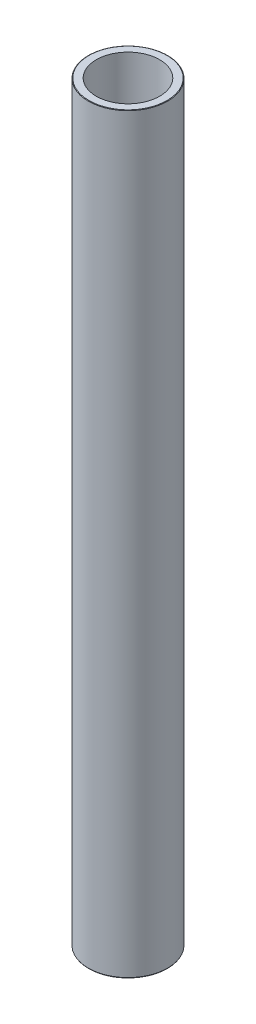
ISO-10303-21;
HEADER;
FILE_DESCRIPTION(('STEP AP214'),'2;1');
FILE_NAME('part.step','',(''),(''),'','','');
FILE_SCHEMA(('AUTOMOTIVE_DESIGN { 1 0 10303 214 1 1 1 1 }'));
ENDSEC;
DATA;
#1=APPLICATION_CONTEXT('core data for automotive mechanical design processes');
#2=APPLICATION_PROTOCOL_DEFINITION('international standard','automotive_design',2000,#1);
#3=PRODUCT_CONTEXT('',#1,'mechanical');
#4=PRODUCT('Part','Part','',(#3));
#5=PRODUCT_RELATED_PRODUCT_CATEGORY('part','',(#4));
#6=PRODUCT_DEFINITION_FORMATION('','',#4);
#7=PRODUCT_DEFINITION_CONTEXT('part definition',#1,'design');
#8=PRODUCT_DEFINITION('design','',#6,#7);
#9=PRODUCT_DEFINITION_SHAPE('','',#8);
#10=(LENGTH_UNIT() NAMED_UNIT(*) SI_UNIT(.MILLI.,.METRE.));
#11=(NAMED_UNIT(*) PLANE_ANGLE_UNIT() SI_UNIT($,.RADIAN.));
#12=(NAMED_UNIT(*) SI_UNIT($,.STERADIAN.) SOLID_ANGLE_UNIT());
#13=UNCERTAINTY_MEASURE_WITH_UNIT(LENGTH_MEASURE(1.E-05),#10,'distance_accuracy_value','');
#14=(GEOMETRIC_REPRESENTATION_CONTEXT(3) GLOBAL_UNCERTAINTY_ASSIGNED_CONTEXT((#13)) GLOBAL_UNIT_ASSIGNED_CONTEXT((#10,
#11,#12)) REPRESENTATION_CONTEXT('',''));
#15=CARTESIAN_POINT('',(0.,0.,0.));
#16=DIRECTION('',(0.,0.,1.));
#17=DIRECTION('',(1.,0.,0.));
#18=AXIS2_PLACEMENT_3D('',#15,#16,#17);
#19=CARTESIAN_POINT('',(0.,569.152457973515,0.));
#20=DIRECTION('',(0.,-1.,0.));
#21=DIRECTION('',(0.,0.,-1.));
#22=AXIS2_PLACEMENT_3D('',#19,#20,#21);
#23=CYLINDRICAL_SURFACE('',#22,30.);
#24=CARTESIAN_POINT('',(0.,568.898428323587,0.));
#25=DIRECTION('',(0.,1.,0.));
#26=DIRECTION('',(0.,0.,1.));
#27=AXIS2_PLACEMENT_3D('',#24,#25,#26);
#28=CIRCLE('',#27,30.);
#29=CARTESIAN_POINT('',(0.,568.898428323587,30.));
#30=VERTEX_POINT('',#29);
#31=EDGE_CURVE('E50',#30,#30,#28,.F.);
#32=ORIENTED_EDGE('',*,*,#31,.T.);
#33=EDGE_LOOP('',(#32));
#34=FACE_BOUND('',#33,.T.);
#35=CARTESIAN_POINT('',(0.,0.439992260305333,0.));
#36=DIRECTION('',(0.,1.,0.));
#37=DIRECTION('',(0.,0.,1.));
#38=AXIS2_PLACEMENT_3D('',#35,#36,#37);
#39=CIRCLE('',#38,30.);
#40=CARTESIAN_POINT('',(0.,0.439992260305333,30.));
#41=VERTEX_POINT('',#40);
#42=EDGE_CURVE('E51',#41,#41,#39,.T.);
#43=ORIENTED_EDGE('',*,*,#42,.T.);
#44=EDGE_LOOP('',(#43));
#45=FACE_BOUND('',#44,.T.);
#46=ADVANCED_FACE('F39',(#34,#45),#23,.T.);
#47=CARTESIAN_POINT('',(0.,569.152457973515,0.));
#48=DIRECTION('',(0.,1.,0.));
#49=DIRECTION('',(0.,0.,1.));
#50=AXIS2_PLACEMENT_3D('',#47,#48,#49);
#51=PLANE('',#50);
#52=CARTESIAN_POINT('',(0.,569.152457973515,0.));
#53=DIRECTION('',(0.,1.,0.));
#54=DIRECTION('',(0.,0.,1.));
#55=AXIS2_PLACEMENT_3D('',#52,#53,#54);
#56=CIRCLE('',#55,29.5600077396948);
#57=CARTESIAN_POINT('',(0.,569.152457973515,29.5600077396948));
#58=VERTEX_POINT('',#57);
#59=EDGE_CURVE('E54',#58,#58,#56,.T.);
#60=ORIENTED_EDGE('',*,*,#59,.T.);
#61=EDGE_LOOP('',(#60));
#62=FACE_BOUND('',#61,.T.);
#63=CARTESIAN_POINT('',(0.,569.152457973515,0.));
#64=DIRECTION('',(0.,1.,0.));
#65=DIRECTION('',(0.,0.,1.));
#66=AXIS2_PLACEMENT_3D('',#63,#64,#65);
#67=CIRCLE('',#66,24.0075079726526);
#68=CARTESIAN_POINT('',(0.,569.152457973515,24.0075079726526));
#69=VERTEX_POINT('',#68);
#70=EDGE_CURVE('E58',#69,#69,#67,.T.);
#71=ORIENTED_EDGE('',*,*,#70,.F.);
#72=EDGE_LOOP('',(#71));
#73=FACE_BOUND('',#72,.T.);
#74=ADVANCED_FACE('F69',(#62,#73),#51,.T.);
#75=CARTESIAN_POINT('',(0.,0.,0.));
#76=DIRECTION('',(0.,1.,0.));
#77=DIRECTION('',(0.,0.,1.));
#78=AXIS2_PLACEMENT_3D('',#75,#76,#77);
#79=PLANE('',#78);
#80=CARTESIAN_POINT('',(0.,0.,0.));
#81=DIRECTION('',(0.,1.,0.));
#82=DIRECTION('',(0.,0.,1.));
#83=AXIS2_PLACEMENT_3D('',#80,#81,#82);
#84=CIRCLE('',#83,29.7459703500713);
#85=CARTESIAN_POINT('',(0.,0.,29.7459703500713));
#86=VERTEX_POINT('',#85);
#87=EDGE_CURVE('E10',#86,#86,#84,.F.);
#88=ORIENTED_EDGE('',*,*,#87,.T.);
#89=EDGE_LOOP('',(#88));
#90=FACE_BOUND('',#89,.T.);
#91=CARTESIAN_POINT('',(0.,0.,0.));
#92=DIRECTION('',(0.,1.,0.));
#93=DIRECTION('',(0.,0.,1.));
#94=AXIS2_PLACEMENT_3D('',#91,#92,#93);
#95=CIRCLE('',#94,24.0075079726526);
#96=CARTESIAN_POINT('',(0.,0.,24.0075079726526));
#97=VERTEX_POINT('',#96);
#98=EDGE_CURVE('E63',#97,#97,#95,.T.);
#99=ORIENTED_EDGE('',*,*,#98,.T.);
#100=EDGE_LOOP('',(#99));
#101=FACE_BOUND('',#100,.T.);
#102=ADVANCED_FACE('F75',(#90,#101),#79,.F.);
#103=CARTESIAN_POINT('',(0.,569.152457973515,0.));
#104=DIRECTION('',(0.,-1.,0.));
#105=DIRECTION('',(0.,0.,-1.));
#106=AXIS2_PLACEMENT_3D('',#103,#104,#105);
#107=CYLINDRICAL_SURFACE('',#106,24.0075079726526);
#108=ORIENTED_EDGE('',*,*,#70,.T.);
#109=EDGE_LOOP('',(#108));
#110=FACE_BOUND('',#109,.T.);
#111=ORIENTED_EDGE('',*,*,#98,.F.);
#112=EDGE_LOOP('',(#111));
#113=FACE_BOUND('',#112,.T.);
#114=ADVANCED_FACE('F70',(#110,#113),#107,.F.);
#115=CARTESIAN_POINT('',(0.,569.152457973515,0.));
#116=DIRECTION('',(0.,-1.,0.));
#117=DIRECTION('',(0.,0.,-1.));
#118=AXIS2_PLACEMENT_3D('',#115,#116,#117);
#119=CONICAL_SURFACE('',#118,29.5600077396948,1.04719755119658);
#120=ORIENTED_EDGE('',*,*,#31,.F.);
#121=EDGE_LOOP('',(#120));
#122=FACE_BOUND('',#121,.T.);
#123=ORIENTED_EDGE('',*,*,#59,.F.);
#124=EDGE_LOOP('',(#123));
#125=FACE_BOUND('',#124,.T.);
#126=ADVANCED_FACE('F81',(#122,#125),#119,.T.);
#127=CARTESIAN_POINT('',(0.,0.439992260305333,0.));
#128=DIRECTION('',(0.,1.,0.));
#129=DIRECTION('',(0.,0.,1.));
#130=AXIS2_PLACEMENT_3D('',#127,#128,#129);
#131=CONICAL_SURFACE('',#130,30.,0.523598775598379);
#132=ORIENTED_EDGE('',*,*,#87,.F.);
#133=EDGE_LOOP('',(#132));
#134=FACE_BOUND('',#133,.T.);
#135=ORIENTED_EDGE('',*,*,#42,.F.);
#136=EDGE_LOOP('',(#135));
#137=FACE_BOUND('',#136,.T.);
#138=ADVANCED_FACE('F45',(#134,#137),#131,.T.);
#139=CLOSED_SHELL('',(#46,#74,#102,#114,#126,#138));
#140=MANIFOLD_SOLID_BREP('B2',#139);
#141=ADVANCED_BREP_SHAPE_REPRESENTATION('',(#18,#140),#14);
#142=SHAPE_DEFINITION_REPRESENTATION(#9,#141);
ENDSEC;
END-ISO-10303-21;
